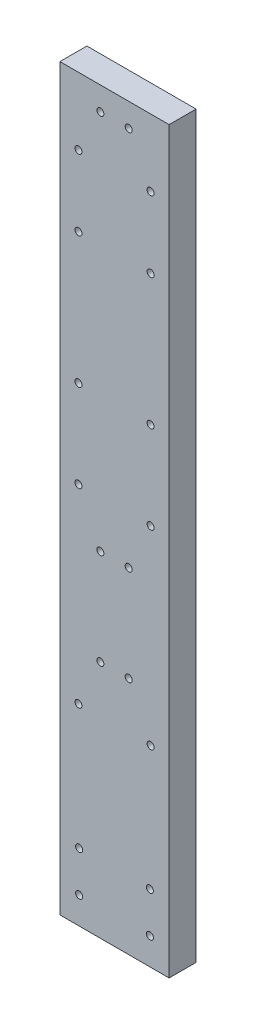
ISO-10303-21;
HEADER;
FILE_DESCRIPTION(('STEP AP214'),'2;1');
FILE_NAME('part.step','',(''),(''),'','','');
FILE_SCHEMA(('AUTOMOTIVE_DESIGN { 1 0 10303 214 1 1 1 1 }'));
ENDSEC;
DATA;
#1=APPLICATION_CONTEXT('core data for automotive mechanical design processes');
#2=APPLICATION_PROTOCOL_DEFINITION('international standard','automotive_design',2000,#1);
#3=PRODUCT_CONTEXT('',#1,'mechanical');
#4=PRODUCT('Part','Part','',(#3));
#5=PRODUCT_RELATED_PRODUCT_CATEGORY('part','',(#4));
#6=PRODUCT_DEFINITION_FORMATION('','',#4);
#7=PRODUCT_DEFINITION_CONTEXT('part definition',#1,'design');
#8=PRODUCT_DEFINITION('design','',#6,#7);
#9=PRODUCT_DEFINITION_SHAPE('','',#8);
#10=(LENGTH_UNIT() NAMED_UNIT(*) SI_UNIT(.MILLI.,.METRE.));
#11=(NAMED_UNIT(*) PLANE_ANGLE_UNIT() SI_UNIT($,.RADIAN.));
#12=(NAMED_UNIT(*) SI_UNIT($,.STERADIAN.) SOLID_ANGLE_UNIT());
#13=UNCERTAINTY_MEASURE_WITH_UNIT(LENGTH_MEASURE(1.E-05),#10,'distance_accuracy_value','');
#14=(GEOMETRIC_REPRESENTATION_CONTEXT(3) GLOBAL_UNCERTAINTY_ASSIGNED_CONTEXT((#13)) GLOBAL_UNIT_ASSIGNED_CONTEXT((#10,
#11,#12)) REPRESENTATION_CONTEXT('',''));
#15=CARTESIAN_POINT('',(0.,0.,0.));
#16=DIRECTION('',(0.,0.,1.));
#17=DIRECTION('',(1.,0.,0.));
#18=AXIS2_PLACEMENT_3D('',#15,#16,#17);
#19=CARTESIAN_POINT('',(0.,0.,4.));
#20=DIRECTION('',(0.,0.,1.));
#21=DIRECTION('',(1.,0.,0.));
#22=AXIS2_PLACEMENT_3D('',#19,#20,#21);
#23=PLANE('',#22);
#24=CARTESIAN_POINT('',(13.35,10.,4.));
#25=DIRECTION('',(0.,0.,1.));
#26=DIRECTION('',(-1.,0.,0.));
#27=AXIS2_PLACEMENT_3D('',#24,#25,#26);
#28=CIRCLE('',#27,0.519960121099866);
#29=CARTESIAN_POINT('',(12.8300398789001,10.,4.));
#30=VERTEX_POINT('',#29);
#31=EDGE_CURVE('E217',#30,#30,#28,.T.);
#32=ORIENTED_EDGE('',*,*,#31,.F.);
#33=EDGE_LOOP('',(#32));
#34=FACE_BOUND('',#33,.T.);
#35=CARTESIAN_POINT('',(2.85,10.,4.));
#36=DIRECTION('',(0.,0.,1.));
#37=DIRECTION('',(1.,0.,0.));
#38=AXIS2_PLACEMENT_3D('',#35,#36,#37);
#39=CIRCLE('',#38,0.519960121099865);
#40=CARTESIAN_POINT('',(3.36996012109986,10.,4.));
#41=VERTEX_POINT('',#40);
#42=EDGE_CURVE('E205',#41,#41,#39,.T.);
#43=ORIENTED_EDGE('',*,*,#42,.F.);
#44=EDGE_LOOP('',(#43));
#45=FACE_BOUND('',#44,.T.);
#46=CARTESIAN_POINT('',(2.74999999999998,69.71,4.));
#47=DIRECTION('',(0.,0.,1.));
#48=DIRECTION('',(1.,0.,0.));
#49=AXIS2_PLACEMENT_3D('',#46,#47,#48);
#50=CIRCLE('',#49,0.519960121099858);
#51=CARTESIAN_POINT('',(3.26996012109984,69.71,4.));
#52=VERTEX_POINT('',#51);
#53=EDGE_CURVE('E193',#52,#52,#50,.T.);
#54=ORIENTED_EDGE('',*,*,#53,.F.);
#55=EDGE_LOOP('',(#54));
#56=FACE_BOUND('',#55,.T.);
#57=CARTESIAN_POINT('',(2.74999999999999,56.71,4.));
#58=DIRECTION('',(0.,0.,1.));
#59=DIRECTION('',(1.,0.,0.));
#60=AXIS2_PLACEMENT_3D('',#57,#58,#59);
#61=CIRCLE('',#60,0.519960121099858);
#62=CARTESIAN_POINT('',(3.26996012109985,56.71,4.));
#63=VERTEX_POINT('',#62);
#64=EDGE_CURVE('E181',#63,#63,#61,.T.);
#65=ORIENTED_EDGE('',*,*,#64,.F.);
#66=EDGE_LOOP('',(#65));
#67=FACE_BOUND('',#66,.T.);
#68=CARTESIAN_POINT('',(10.2,106.16,4.));
#69=DIRECTION('',(0.,0.,1.));
#70=DIRECTION('',(-1.,0.,0.));
#71=AXIS2_PLACEMENT_3D('',#68,#69,#70);
#72=CIRCLE('',#71,0.519960121099869);
#73=CARTESIAN_POINT('',(9.68003987890012,106.16,4.));
#74=VERTEX_POINT('',#73);
#75=EDGE_CURVE('E169',#74,#74,#72,.T.);
#76=ORIENTED_EDGE('',*,*,#75,.F.);
#77=EDGE_LOOP('',(#76));
#78=FACE_BOUND('',#77,.T.);
#79=CARTESIAN_POINT('',(2.74999999999998,89.16,4.));
#80=DIRECTION('',(0.,0.,1.));
#81=DIRECTION('',(-1.,0.,0.));
#82=AXIS2_PLACEMENT_3D('',#79,#80,#81);
#83=CIRCLE('',#82,0.519960121099858);
#84=CARTESIAN_POINT('',(2.23003987890013,89.16,4.));
#85=VERTEX_POINT('',#84);
#86=EDGE_CURVE('E157',#85,#85,#83,.T.);
#87=ORIENTED_EDGE('',*,*,#86,.F.);
#88=EDGE_LOOP('',(#87));
#89=FACE_BOUND('',#88,.T.);
#90=CARTESIAN_POINT('',(2.75,28.5,4.));
#91=DIRECTION('',(0.,0.,1.));
#92=DIRECTION('',(1.,0.,0.));
#93=AXIS2_PLACEMENT_3D('',#90,#91,#92);
#94=CIRCLE('',#93,0.519960121099867);
#95=CARTESIAN_POINT('',(3.26996012109986,28.5,4.));
#96=VERTEX_POINT('',#95);
#97=EDGE_CURVE('E145',#96,#96,#94,.T.);
#98=ORIENTED_EDGE('',*,*,#97,.F.);
#99=EDGE_LOOP('',(#98));
#100=FACE_BOUND('',#99,.T.);
#101=CARTESIAN_POINT('',(6.,35.5,4.));
#102=DIRECTION('',(0.,0.,1.));
#103=DIRECTION('',(1.,0.,0.));
#104=AXIS2_PLACEMENT_3D('',#101,#102,#103);
#105=CIRCLE('',#104,0.51996012109988);
#106=CARTESIAN_POINT('',(6.51996012109988,35.5,4.));
#107=VERTEX_POINT('',#106);
#108=EDGE_CURVE('E133',#107,#107,#105,.T.);
#109=ORIENTED_EDGE('',*,*,#108,.F.);
#110=EDGE_LOOP('',(#109));
#111=FACE_BOUND('',#110,.T.);
#112=CARTESIAN_POINT('',(5.99999999999999,49.71,4.));
#113=DIRECTION('',(0.,0.,1.));
#114=DIRECTION('',(1.,0.,0.));
#115=AXIS2_PLACEMENT_3D('',#112,#113,#114);
#116=CIRCLE('',#115,0.519960121099861);
#117=CARTESIAN_POINT('',(6.51996012109985,49.71,4.));
#118=VERTEX_POINT('',#117);
#119=EDGE_CURVE('E121',#118,#118,#116,.T.);
#120=ORIENTED_EDGE('',*,*,#119,.F.);
#121=EDGE_LOOP('',(#120));
#122=FACE_BOUND('',#121,.T.);
#123=CARTESIAN_POINT('',(5.99999999999999,106.16,4.));
#124=DIRECTION('',(0.,0.,1.));
#125=DIRECTION('',(1.,0.,0.));
#126=AXIS2_PLACEMENT_3D('',#123,#124,#125);
#127=CIRCLE('',#126,0.519960121099861);
#128=CARTESIAN_POINT('',(6.51996012109985,106.16,4.));
#129=VERTEX_POINT('',#128);
#130=EDGE_CURVE('E100',#129,#129,#127,.T.);
#131=ORIENTED_EDGE('',*,*,#130,.F.);
#132=EDGE_LOOP('',(#131));
#133=FACE_BOUND('',#132,.T.);
#134=DIRECTION('',(0.,-1.,0.));
#135=VECTOR('',#134,1.);
#136=CARTESIAN_POINT('',(0.,109.64,4.));
#137=LINE('',#136,#135);
#138=CARTESIAN_POINT('',(0.,109.64,4.));
#139=VERTEX_POINT('',#138);
#140=CARTESIAN_POINT('',(0.,0.,4.));
#141=VERTEX_POINT('',#140);
#142=EDGE_CURVE('E85',#139,#141,#137,.T.);
#143=ORIENTED_EDGE('',*,*,#142,.T.);
#144=DIRECTION('',(1.,0.,0.));
#145=VECTOR('',#144,1.);
#146=CARTESIAN_POINT('',(0.,0.,4.));
#147=LINE('',#146,#145);
#148=CARTESIAN_POINT('',(16.2,0.,4.));
#149=VERTEX_POINT('',#148);
#150=EDGE_CURVE('E80',#141,#149,#147,.T.);
#151=ORIENTED_EDGE('',*,*,#150,.T.);
#152=DIRECTION('',(0.,1.,0.));
#153=VECTOR('',#152,1.);
#154=CARTESIAN_POINT('',(16.2,0.,4.));
#155=LINE('',#154,#153);
#156=CARTESIAN_POINT('',(16.2,109.64,4.));
#157=VERTEX_POINT('',#156);
#158=EDGE_CURVE('E83',#149,#157,#155,.T.);
#159=ORIENTED_EDGE('',*,*,#158,.T.);
#160=DIRECTION('',(-1.,0.,0.));
#161=VECTOR('',#160,1.);
#162=CARTESIAN_POINT('',(16.2,109.64,4.));
#163=LINE('',#162,#161);
#164=EDGE_CURVE('E50',#157,#139,#163,.T.);
#165=ORIENTED_EDGE('',*,*,#164,.T.);
#166=EDGE_LOOP('',(#143,#151,#159,#165));
#167=FACE_BOUND('',#166,.T.);
#168=CARTESIAN_POINT('',(10.2,49.71,4.));
#169=DIRECTION('',(0.,0.,1.));
#170=DIRECTION('',(1.,0.,0.));
#171=AXIS2_PLACEMENT_3D('',#168,#169,#170);
#172=CIRCLE('',#171,0.519960121099864);
#173=CARTESIAN_POINT('',(10.7199601210999,49.71,4.));
#174=VERTEX_POINT('',#173);
#175=EDGE_CURVE('E115',#174,#174,#172,.T.);
#176=ORIENTED_EDGE('',*,*,#175,.F.);
#177=EDGE_LOOP('',(#176));
#178=FACE_BOUND('',#177,.T.);
#179=CARTESIAN_POINT('',(10.2,35.5,4.));
#180=DIRECTION('',(0.,0.,1.));
#181=DIRECTION('',(1.,0.,0.));
#182=AXIS2_PLACEMENT_3D('',#179,#180,#181);
#183=CIRCLE('',#182,0.519960121099865);
#184=CARTESIAN_POINT('',(10.7199601210999,35.5,4.));
#185=VERTEX_POINT('',#184);
#186=EDGE_CURVE('E127',#185,#185,#183,.T.);
#187=ORIENTED_EDGE('',*,*,#186,.F.);
#188=EDGE_LOOP('',(#187));
#189=FACE_BOUND('',#188,.T.);
#190=CARTESIAN_POINT('',(13.45,28.5,4.));
#191=DIRECTION('',(0.,0.,1.));
#192=DIRECTION('',(1.,0.,0.));
#193=AXIS2_PLACEMENT_3D('',#190,#191,#192);
#194=CIRCLE('',#193,0.519960121099865);
#195=CARTESIAN_POINT('',(13.9699601210999,28.5,4.));
#196=VERTEX_POINT('',#195);
#197=EDGE_CURVE('E139',#196,#196,#194,.T.);
#198=ORIENTED_EDGE('',*,*,#197,.F.);
#199=EDGE_LOOP('',(#198));
#200=FACE_BOUND('',#199,.T.);
#201=CARTESIAN_POINT('',(13.45,56.71,4.));
#202=DIRECTION('',(0.,0.,1.));
#203=DIRECTION('',(1.,0.,0.));
#204=AXIS2_PLACEMENT_3D('',#201,#202,#203);
#205=CIRCLE('',#204,0.519960121099861);
#206=CARTESIAN_POINT('',(13.9699601210999,56.71,4.));
#207=VERTEX_POINT('',#206);
#208=EDGE_CURVE('E151',#207,#207,#205,.T.);
#209=ORIENTED_EDGE('',*,*,#208,.F.);
#210=EDGE_LOOP('',(#209));
#211=FACE_BOUND('',#210,.T.);
#212=CARTESIAN_POINT('',(13.45,89.16,4.));
#213=DIRECTION('',(0.,0.,1.));
#214=DIRECTION('',(-1.,0.,0.));
#215=AXIS2_PLACEMENT_3D('',#212,#213,#214);
#216=CIRCLE('',#215,0.519960121099861);
#217=CARTESIAN_POINT('',(12.9300398789001,89.16,4.));
#218=VERTEX_POINT('',#217);
#219=EDGE_CURVE('E163',#218,#218,#216,.T.);
#220=ORIENTED_EDGE('',*,*,#219,.F.);
#221=EDGE_LOOP('',(#220));
#222=FACE_BOUND('',#221,.T.);
#223=CARTESIAN_POINT('',(13.45,99.66,4.));
#224=DIRECTION('',(0.,0.,1.));
#225=DIRECTION('',(-1.,0.,0.));
#226=AXIS2_PLACEMENT_3D('',#223,#224,#225);
#227=CIRCLE('',#226,0.519960121099862);
#228=CARTESIAN_POINT('',(12.9300398789001,99.66,4.));
#229=VERTEX_POINT('',#228);
#230=EDGE_CURVE('E175',#229,#229,#227,.T.);
#231=ORIENTED_EDGE('',*,*,#230,.F.);
#232=EDGE_LOOP('',(#231));
#233=FACE_BOUND('',#232,.T.);
#234=CARTESIAN_POINT('',(13.45,69.71,4.));
#235=DIRECTION('',(0.,0.,1.));
#236=DIRECTION('',(1.,0.,0.));
#237=AXIS2_PLACEMENT_3D('',#234,#235,#236);
#238=CIRCLE('',#237,0.519960121099861);
#239=CARTESIAN_POINT('',(13.9699601210999,69.71,4.));
#240=VERTEX_POINT('',#239);
#241=EDGE_CURVE('E187',#240,#240,#238,.T.);
#242=ORIENTED_EDGE('',*,*,#241,.F.);
#243=EDGE_LOOP('',(#242));
#244=FACE_BOUND('',#243,.T.);
#245=CARTESIAN_POINT('',(2.74999999999999,99.66,4.));
#246=DIRECTION('',(0.,0.,1.));
#247=DIRECTION('',(1.,0.,0.));
#248=AXIS2_PLACEMENT_3D('',#245,#246,#247);
#249=CIRCLE('',#248,0.519960121099858);
#250=CARTESIAN_POINT('',(3.26996012109985,99.66,4.));
#251=VERTEX_POINT('',#250);
#252=EDGE_CURVE('E199',#251,#251,#249,.T.);
#253=ORIENTED_EDGE('',*,*,#252,.F.);
#254=EDGE_LOOP('',(#253));
#255=FACE_BOUND('',#254,.T.);
#256=CARTESIAN_POINT('',(2.85,4.,4.));
#257=DIRECTION('',(0.,0.,1.));
#258=DIRECTION('',(1.,0.,0.));
#259=AXIS2_PLACEMENT_3D('',#256,#257,#258);
#260=CIRCLE('',#259,0.519960121099865);
#261=CARTESIAN_POINT('',(3.36996012109986,4.,4.));
#262=VERTEX_POINT('',#261);
#263=EDGE_CURVE('E211',#262,#262,#260,.T.);
#264=ORIENTED_EDGE('',*,*,#263,.F.);
#265=EDGE_LOOP('',(#264));
#266=FACE_BOUND('',#265,.T.);
#267=CARTESIAN_POINT('',(13.35,4.,4.));
#268=DIRECTION('',(0.,0.,1.));
#269=DIRECTION('',(-1.,0.,0.));
#270=AXIS2_PLACEMENT_3D('',#267,#268,#269);
#271=CIRCLE('',#270,0.519960121099866);
#272=CARTESIAN_POINT('',(12.8300398789001,4.,4.));
#273=VERTEX_POINT('',#272);
#274=EDGE_CURVE('E223',#273,#273,#271,.T.);
#275=ORIENTED_EDGE('',*,*,#274,.F.);
#276=EDGE_LOOP('',(#275));
#277=FACE_BOUND('',#276,.T.);
#278=ADVANCED_FACE('F33',(#34,#45,#56,#67,#78,#89,#100,#111,#122,#133,#167,#178,#189,#200,#211,
#222,#233,#244,#255,#266,#277),#23,.T.);
#279=CARTESIAN_POINT('',(0.,0.,0.));
#280=DIRECTION('',(0.,0.,1.));
#281=DIRECTION('',(1.,0.,0.));
#282=AXIS2_PLACEMENT_3D('',#279,#280,#281);
#283=PLANE('',#282);
#284=CARTESIAN_POINT('',(13.35,10.,0.));
#285=DIRECTION('',(0.,0.,1.));
#286=DIRECTION('',(-1.,0.,0.));
#287=AXIS2_PLACEMENT_3D('',#284,#285,#286);
#288=CIRCLE('',#287,0.519960121099866);
#289=CARTESIAN_POINT('',(12.8300398789001,10.,0.));
#290=VERTEX_POINT('',#289);
#291=EDGE_CURVE('E220',#290,#290,#288,.T.);
#292=ORIENTED_EDGE('',*,*,#291,.T.);
#293=EDGE_LOOP('',(#292));
#294=FACE_BOUND('',#293,.T.);
#295=CARTESIAN_POINT('',(2.85,10.,0.));
#296=DIRECTION('',(0.,0.,1.));
#297=DIRECTION('',(1.,0.,0.));
#298=AXIS2_PLACEMENT_3D('',#295,#296,#297);
#299=CIRCLE('',#298,0.519960121099865);
#300=CARTESIAN_POINT('',(3.36996012109986,10.,0.));
#301=VERTEX_POINT('',#300);
#302=EDGE_CURVE('E208',#301,#301,#299,.T.);
#303=ORIENTED_EDGE('',*,*,#302,.T.);
#304=EDGE_LOOP('',(#303));
#305=FACE_BOUND('',#304,.T.);
#306=CARTESIAN_POINT('',(2.74999999999998,69.71,0.));
#307=DIRECTION('',(0.,0.,1.));
#308=DIRECTION('',(1.,0.,0.));
#309=AXIS2_PLACEMENT_3D('',#306,#307,#308);
#310=CIRCLE('',#309,0.519960121099858);
#311=CARTESIAN_POINT('',(3.26996012109984,69.71,0.));
#312=VERTEX_POINT('',#311);
#313=EDGE_CURVE('E196',#312,#312,#310,.T.);
#314=ORIENTED_EDGE('',*,*,#313,.T.);
#315=EDGE_LOOP('',(#314));
#316=FACE_BOUND('',#315,.T.);
#317=CARTESIAN_POINT('',(2.74999999999999,56.71,0.));
#318=DIRECTION('',(0.,0.,1.));
#319=DIRECTION('',(1.,0.,0.));
#320=AXIS2_PLACEMENT_3D('',#317,#318,#319);
#321=CIRCLE('',#320,0.519960121099858);
#322=CARTESIAN_POINT('',(3.26996012109985,56.71,0.));
#323=VERTEX_POINT('',#322);
#324=EDGE_CURVE('E184',#323,#323,#321,.T.);
#325=ORIENTED_EDGE('',*,*,#324,.T.);
#326=EDGE_LOOP('',(#325));
#327=FACE_BOUND('',#326,.T.);
#328=CARTESIAN_POINT('',(10.2,106.16,0.));
#329=DIRECTION('',(0.,0.,1.));
#330=DIRECTION('',(-1.,0.,0.));
#331=AXIS2_PLACEMENT_3D('',#328,#329,#330);
#332=CIRCLE('',#331,0.519960121099869);
#333=CARTESIAN_POINT('',(9.68003987890012,106.16,0.));
#334=VERTEX_POINT('',#333);
#335=EDGE_CURVE('E172',#334,#334,#332,.T.);
#336=ORIENTED_EDGE('',*,*,#335,.T.);
#337=EDGE_LOOP('',(#336));
#338=FACE_BOUND('',#337,.T.);
#339=CARTESIAN_POINT('',(2.74999999999998,89.16,0.));
#340=DIRECTION('',(0.,0.,1.));
#341=DIRECTION('',(-1.,0.,0.));
#342=AXIS2_PLACEMENT_3D('',#339,#340,#341);
#343=CIRCLE('',#342,0.519960121099858);
#344=CARTESIAN_POINT('',(2.23003987890013,89.16,0.));
#345=VERTEX_POINT('',#344);
#346=EDGE_CURVE('E160',#345,#345,#343,.T.);
#347=ORIENTED_EDGE('',*,*,#346,.T.);
#348=EDGE_LOOP('',(#347));
#349=FACE_BOUND('',#348,.T.);
#350=CARTESIAN_POINT('',(2.75,28.5,0.));
#351=DIRECTION('',(0.,0.,1.));
#352=DIRECTION('',(1.,0.,0.));
#353=AXIS2_PLACEMENT_3D('',#350,#351,#352);
#354=CIRCLE('',#353,0.519960121099867);
#355=CARTESIAN_POINT('',(3.26996012109986,28.5,0.));
#356=VERTEX_POINT('',#355);
#357=EDGE_CURVE('E148',#356,#356,#354,.T.);
#358=ORIENTED_EDGE('',*,*,#357,.T.);
#359=EDGE_LOOP('',(#358));
#360=FACE_BOUND('',#359,.T.);
#361=CARTESIAN_POINT('',(6.,35.5,0.));
#362=DIRECTION('',(0.,0.,1.));
#363=DIRECTION('',(1.,0.,0.));
#364=AXIS2_PLACEMENT_3D('',#361,#362,#363);
#365=CIRCLE('',#364,0.51996012109988);
#366=CARTESIAN_POINT('',(6.51996012109988,35.5,0.));
#367=VERTEX_POINT('',#366);
#368=EDGE_CURVE('E136',#367,#367,#365,.T.);
#369=ORIENTED_EDGE('',*,*,#368,.T.);
#370=EDGE_LOOP('',(#369));
#371=FACE_BOUND('',#370,.T.);
#372=CARTESIAN_POINT('',(5.99999999999999,49.71,0.));
#373=DIRECTION('',(0.,0.,1.));
#374=DIRECTION('',(1.,0.,0.));
#375=AXIS2_PLACEMENT_3D('',#372,#373,#374);
#376=CIRCLE('',#375,0.519960121099861);
#377=CARTESIAN_POINT('',(6.51996012109985,49.71,0.));
#378=VERTEX_POINT('',#377);
#379=EDGE_CURVE('E124',#378,#378,#376,.T.);
#380=ORIENTED_EDGE('',*,*,#379,.T.);
#381=EDGE_LOOP('',(#380));
#382=FACE_BOUND('',#381,.T.);
#383=CARTESIAN_POINT('',(5.99999999999999,106.16,0.));
#384=DIRECTION('',(0.,0.,1.));
#385=DIRECTION('',(1.,0.,0.));
#386=AXIS2_PLACEMENT_3D('',#383,#384,#385);
#387=CIRCLE('',#386,0.519960121099861);
#388=CARTESIAN_POINT('',(6.51996012109985,106.16,0.));
#389=VERTEX_POINT('',#388);
#390=EDGE_CURVE('E112',#389,#389,#387,.T.);
#391=ORIENTED_EDGE('',*,*,#390,.T.);
#392=EDGE_LOOP('',(#391));
#393=FACE_BOUND('',#392,.T.);
#394=DIRECTION('',(0.,-1.,0.));
#395=VECTOR('',#394,1.);
#396=CARTESIAN_POINT('',(0.,109.64,0.));
#397=LINE('',#396,#395);
#398=CARTESIAN_POINT('',(0.,109.64,0.));
#399=VERTEX_POINT('',#398);
#400=CARTESIAN_POINT('',(0.,0.,0.));
#401=VERTEX_POINT('',#400);
#402=EDGE_CURVE('E97',#399,#401,#397,.T.);
#403=ORIENTED_EDGE('',*,*,#402,.F.);
#404=DIRECTION('',(-1.,0.,0.));
#405=VECTOR('',#404,1.);
#406=CARTESIAN_POINT('',(16.2,109.64,0.));
#407=LINE('',#406,#405);
#408=CARTESIAN_POINT('',(16.2,109.64,0.));
#409=VERTEX_POINT('',#408);
#410=EDGE_CURVE('E73',#409,#399,#407,.T.);
#411=ORIENTED_EDGE('',*,*,#410,.F.);
#412=DIRECTION('',(0.,1.,0.));
#413=VECTOR('',#412,1.);
#414=CARTESIAN_POINT('',(16.2,0.,0.));
#415=LINE('',#414,#413);
#416=CARTESIAN_POINT('',(16.2,0.,0.));
#417=VERTEX_POINT('',#416);
#418=EDGE_CURVE('E67',#417,#409,#415,.T.);
#419=ORIENTED_EDGE('',*,*,#418,.F.);
#420=DIRECTION('',(1.,0.,0.));
#421=VECTOR('',#420,1.);
#422=CARTESIAN_POINT('',(0.,0.,0.));
#423=LINE('',#422,#421);
#424=EDGE_CURVE('E89',#401,#417,#423,.T.);
#425=ORIENTED_EDGE('',*,*,#424,.F.);
#426=EDGE_LOOP('',(#403,#411,#419,#425));
#427=FACE_BOUND('',#426,.T.);
#428=CARTESIAN_POINT('',(10.2,49.71,0.));
#429=DIRECTION('',(0.,0.,1.));
#430=DIRECTION('',(1.,0.,0.));
#431=AXIS2_PLACEMENT_3D('',#428,#429,#430);
#432=CIRCLE('',#431,0.519960121099864);
#433=CARTESIAN_POINT('',(10.7199601210999,49.71,0.));
#434=VERTEX_POINT('',#433);
#435=EDGE_CURVE('E118',#434,#434,#432,.T.);
#436=ORIENTED_EDGE('',*,*,#435,.T.);
#437=EDGE_LOOP('',(#436));
#438=FACE_BOUND('',#437,.T.);
#439=CARTESIAN_POINT('',(10.2,35.5,0.));
#440=DIRECTION('',(0.,0.,1.));
#441=DIRECTION('',(1.,0.,0.));
#442=AXIS2_PLACEMENT_3D('',#439,#440,#441);
#443=CIRCLE('',#442,0.519960121099865);
#444=CARTESIAN_POINT('',(10.7199601210999,35.5,0.));
#445=VERTEX_POINT('',#444);
#446=EDGE_CURVE('E130',#445,#445,#443,.T.);
#447=ORIENTED_EDGE('',*,*,#446,.T.);
#448=EDGE_LOOP('',(#447));
#449=FACE_BOUND('',#448,.T.);
#450=CARTESIAN_POINT('',(13.45,28.5,0.));
#451=DIRECTION('',(0.,0.,1.));
#452=DIRECTION('',(1.,0.,0.));
#453=AXIS2_PLACEMENT_3D('',#450,#451,#452);
#454=CIRCLE('',#453,0.519960121099865);
#455=CARTESIAN_POINT('',(13.9699601210999,28.5,0.));
#456=VERTEX_POINT('',#455);
#457=EDGE_CURVE('E142',#456,#456,#454,.T.);
#458=ORIENTED_EDGE('',*,*,#457,.T.);
#459=EDGE_LOOP('',(#458));
#460=FACE_BOUND('',#459,.T.);
#461=CARTESIAN_POINT('',(13.45,56.71,0.));
#462=DIRECTION('',(0.,0.,1.));
#463=DIRECTION('',(1.,0.,0.));
#464=AXIS2_PLACEMENT_3D('',#461,#462,#463);
#465=CIRCLE('',#464,0.519960121099861);
#466=CARTESIAN_POINT('',(13.9699601210999,56.71,0.));
#467=VERTEX_POINT('',#466);
#468=EDGE_CURVE('E154',#467,#467,#465,.T.);
#469=ORIENTED_EDGE('',*,*,#468,.T.);
#470=EDGE_LOOP('',(#469));
#471=FACE_BOUND('',#470,.T.);
#472=CARTESIAN_POINT('',(13.45,89.16,0.));
#473=DIRECTION('',(0.,0.,1.));
#474=DIRECTION('',(-1.,0.,0.));
#475=AXIS2_PLACEMENT_3D('',#472,#473,#474);
#476=CIRCLE('',#475,0.519960121099861);
#477=CARTESIAN_POINT('',(12.9300398789001,89.16,0.));
#478=VERTEX_POINT('',#477);
#479=EDGE_CURVE('E166',#478,#478,#476,.T.);
#480=ORIENTED_EDGE('',*,*,#479,.T.);
#481=EDGE_LOOP('',(#480));
#482=FACE_BOUND('',#481,.T.);
#483=CARTESIAN_POINT('',(13.45,99.66,0.));
#484=DIRECTION('',(0.,0.,1.));
#485=DIRECTION('',(-1.,0.,0.));
#486=AXIS2_PLACEMENT_3D('',#483,#484,#485);
#487=CIRCLE('',#486,0.519960121099862);
#488=CARTESIAN_POINT('',(12.9300398789001,99.66,0.));
#489=VERTEX_POINT('',#488);
#490=EDGE_CURVE('E178',#489,#489,#487,.T.);
#491=ORIENTED_EDGE('',*,*,#490,.T.);
#492=EDGE_LOOP('',(#491));
#493=FACE_BOUND('',#492,.T.);
#494=CARTESIAN_POINT('',(13.45,69.71,0.));
#495=DIRECTION('',(0.,0.,1.));
#496=DIRECTION('',(1.,0.,0.));
#497=AXIS2_PLACEMENT_3D('',#494,#495,#496);
#498=CIRCLE('',#497,0.519960121099861);
#499=CARTESIAN_POINT('',(13.9699601210999,69.71,0.));
#500=VERTEX_POINT('',#499);
#501=EDGE_CURVE('E190',#500,#500,#498,.T.);
#502=ORIENTED_EDGE('',*,*,#501,.T.);
#503=EDGE_LOOP('',(#502));
#504=FACE_BOUND('',#503,.T.);
#505=CARTESIAN_POINT('',(2.74999999999999,99.66,0.));
#506=DIRECTION('',(0.,0.,1.));
#507=DIRECTION('',(1.,0.,0.));
#508=AXIS2_PLACEMENT_3D('',#505,#506,#507);
#509=CIRCLE('',#508,0.519960121099858);
#510=CARTESIAN_POINT('',(3.26996012109985,99.66,0.));
#511=VERTEX_POINT('',#510);
#512=EDGE_CURVE('E202',#511,#511,#509,.T.);
#513=ORIENTED_EDGE('',*,*,#512,.T.);
#514=EDGE_LOOP('',(#513));
#515=FACE_BOUND('',#514,.T.);
#516=CARTESIAN_POINT('',(2.85,4.,0.));
#517=DIRECTION('',(0.,0.,1.));
#518=DIRECTION('',(1.,0.,0.));
#519=AXIS2_PLACEMENT_3D('',#516,#517,#518);
#520=CIRCLE('',#519,0.519960121099865);
#521=CARTESIAN_POINT('',(3.36996012109986,4.,0.));
#522=VERTEX_POINT('',#521);
#523=EDGE_CURVE('E214',#522,#522,#520,.T.);
#524=ORIENTED_EDGE('',*,*,#523,.T.);
#525=EDGE_LOOP('',(#524));
#526=FACE_BOUND('',#525,.T.);
#527=CARTESIAN_POINT('',(13.35,4.,0.));
#528=DIRECTION('',(0.,0.,1.));
#529=DIRECTION('',(-1.,0.,0.));
#530=AXIS2_PLACEMENT_3D('',#527,#528,#529);
#531=CIRCLE('',#530,0.519960121099866);
#532=CARTESIAN_POINT('',(12.8300398789001,4.,0.));
#533=VERTEX_POINT('',#532);
#534=EDGE_CURVE('E226',#533,#533,#531,.T.);
#535=ORIENTED_EDGE('',*,*,#534,.T.);
#536=EDGE_LOOP('',(#535));
#537=FACE_BOUND('',#536,.T.);
#538=ADVANCED_FACE('F108',(#294,#305,#316,#327,#338,#349,#360,#371,#382,#393,#427,#438,#449,
#460,#471,#482,#493,#504,#515,#526,#537),#283,.F.);
#539=CARTESIAN_POINT('',(0.,109.64,4.));
#540=DIRECTION('',(1.,0.,0.));
#541=DIRECTION('',(0.,1.,0.));
#542=AXIS2_PLACEMENT_3D('',#539,#540,#541);
#543=PLANE('',#542);
#544=ORIENTED_EDGE('',*,*,#402,.T.);
#545=DIRECTION('',(0.,0.,-1.));
#546=VECTOR('',#545,1.);
#547=CARTESIAN_POINT('',(0.,0.,4.));
#548=LINE('',#547,#546);
#549=EDGE_CURVE('E11',#141,#401,#548,.T.);
#550=ORIENTED_EDGE('',*,*,#549,.F.);
#551=ORIENTED_EDGE('',*,*,#142,.F.);
#552=DIRECTION('',(0.,0.,-1.));
#553=VECTOR('',#552,1.);
#554=CARTESIAN_POINT('',(0.,109.64,4.));
#555=LINE('',#554,#553);
#556=EDGE_CURVE('E93',#139,#399,#555,.T.);
#557=ORIENTED_EDGE('',*,*,#556,.T.);
#558=EDGE_LOOP('',(#544,#550,#551,#557));
#559=FACE_BOUND('',#558,.T.);
#560=ADVANCED_FACE('F35',(#559),#543,.F.);
#561=CARTESIAN_POINT('',(0.,0.,4.));
#562=DIRECTION('',(0.,1.,0.));
#563=DIRECTION('',(-1.,0.,0.));
#564=AXIS2_PLACEMENT_3D('',#561,#562,#563);
#565=PLANE('',#564);
#566=ORIENTED_EDGE('',*,*,#424,.T.);
#567=DIRECTION('',(0.,0.,-1.));
#568=VECTOR('',#567,1.);
#569=CARTESIAN_POINT('',(16.2,0.,4.));
#570=LINE('',#569,#568);
#571=EDGE_CURVE('E42',#149,#417,#570,.T.);
#572=ORIENTED_EDGE('',*,*,#571,.F.);
#573=ORIENTED_EDGE('',*,*,#150,.F.);
#574=ORIENTED_EDGE('',*,*,#549,.T.);
#575=EDGE_LOOP('',(#566,#572,#573,#574));
#576=FACE_BOUND('',#575,.T.);
#577=ADVANCED_FACE('F88',(#576),#565,.F.);
#578=CARTESIAN_POINT('',(16.2,0.,4.));
#579=DIRECTION('',(-1.,0.,0.));
#580=DIRECTION('',(0.,-1.,0.));
#581=AXIS2_PLACEMENT_3D('',#578,#579,#580);
#582=PLANE('',#581);
#583=ORIENTED_EDGE('',*,*,#418,.T.);
#584=DIRECTION('',(0.,0.,-1.));
#585=VECTOR('',#584,1.);
#586=CARTESIAN_POINT('',(16.2,109.64,4.));
#587=LINE('',#586,#585);
#588=EDGE_CURVE('E90',#157,#409,#587,.T.);
#589=ORIENTED_EDGE('',*,*,#588,.F.);
#590=ORIENTED_EDGE('',*,*,#158,.F.);
#591=ORIENTED_EDGE('',*,*,#571,.T.);
#592=EDGE_LOOP('',(#583,#589,#590,#591));
#593=FACE_BOUND('',#592,.T.);
#594=ADVANCED_FACE('F91',(#593),#582,.F.);
#595=CARTESIAN_POINT('',(16.2,109.64,4.));
#596=DIRECTION('',(0.,-1.,0.));
#597=DIRECTION('',(0.,0.,-1.));
#598=AXIS2_PLACEMENT_3D('',#595,#596,#597);
#599=PLANE('',#598);
#600=ORIENTED_EDGE('',*,*,#410,.T.);
#601=ORIENTED_EDGE('',*,*,#556,.F.);
#602=ORIENTED_EDGE('',*,*,#164,.F.);
#603=ORIENTED_EDGE('',*,*,#588,.T.);
#604=EDGE_LOOP('',(#600,#601,#602,#603));
#605=FACE_BOUND('',#604,.T.);
#606=ADVANCED_FACE('F105',(#605),#599,.F.);
#607=CARTESIAN_POINT('',(5.99999999999999,106.16,4.));
#608=DIRECTION('',(0.,0.,-1.));
#609=DIRECTION('',(-1.,0.,0.));
#610=AXIS2_PLACEMENT_3D('',#607,#608,#609);
#611=CYLINDRICAL_SURFACE('',#610,0.519960121099861);
#612=ORIENTED_EDGE('',*,*,#130,.T.);
#613=EDGE_LOOP('',(#612));
#614=FACE_BOUND('',#613,.T.);
#615=ORIENTED_EDGE('',*,*,#390,.F.);
#616=EDGE_LOOP('',(#615));
#617=FACE_BOUND('',#616,.T.);
#618=ADVANCED_FACE('F246',(#614,#617),#611,.F.);
#619=CARTESIAN_POINT('',(10.2,49.71,4.));
#620=DIRECTION('',(0.,0.,-1.));
#621=DIRECTION('',(-1.,0.,0.));
#622=AXIS2_PLACEMENT_3D('',#619,#620,#621);
#623=CYLINDRICAL_SURFACE('',#622,0.519960121099864);
#624=ORIENTED_EDGE('',*,*,#175,.T.);
#625=EDGE_LOOP('',(#624));
#626=FACE_BOUND('',#625,.T.);
#627=ORIENTED_EDGE('',*,*,#435,.F.);
#628=EDGE_LOOP('',(#627));
#629=FACE_BOUND('',#628,.T.);
#630=ADVANCED_FACE('F292',(#626,#629),#623,.F.);
#631=CARTESIAN_POINT('',(5.99999999999999,49.71,4.));
#632=DIRECTION('',(0.,0.,-1.));
#633=DIRECTION('',(-1.,0.,0.));
#634=AXIS2_PLACEMENT_3D('',#631,#632,#633);
#635=CYLINDRICAL_SURFACE('',#634,0.519960121099861);
#636=ORIENTED_EDGE('',*,*,#119,.T.);
#637=EDGE_LOOP('',(#636));
#638=FACE_BOUND('',#637,.T.);
#639=ORIENTED_EDGE('',*,*,#379,.F.);
#640=EDGE_LOOP('',(#639));
#641=FACE_BOUND('',#640,.T.);
#642=ADVANCED_FACE('F300',(#638,#641),#635,.F.);
#643=CARTESIAN_POINT('',(10.2,35.5,4.));
#644=DIRECTION('',(0.,0.,-1.));
#645=DIRECTION('',(-1.,0.,0.));
#646=AXIS2_PLACEMENT_3D('',#643,#644,#645);
#647=CYLINDRICAL_SURFACE('',#646,0.519960121099865);
#648=ORIENTED_EDGE('',*,*,#186,.T.);
#649=EDGE_LOOP('',(#648));
#650=FACE_BOUND('',#649,.T.);
#651=ORIENTED_EDGE('',*,*,#446,.F.);
#652=EDGE_LOOP('',(#651));
#653=FACE_BOUND('',#652,.T.);
#654=ADVANCED_FACE('F308',(#650,#653),#647,.F.);
#655=CARTESIAN_POINT('',(6.,35.5,4.));
#656=DIRECTION('',(0.,0.,-1.));
#657=DIRECTION('',(-1.,0.,0.));
#658=AXIS2_PLACEMENT_3D('',#655,#656,#657);
#659=CYLINDRICAL_SURFACE('',#658,0.51996012109988);
#660=ORIENTED_EDGE('',*,*,#108,.T.);
#661=EDGE_LOOP('',(#660));
#662=FACE_BOUND('',#661,.T.);
#663=ORIENTED_EDGE('',*,*,#368,.F.);
#664=EDGE_LOOP('',(#663));
#665=FACE_BOUND('',#664,.T.);
#666=ADVANCED_FACE('F317',(#662,#665),#659,.F.);
#667=CARTESIAN_POINT('',(13.45,28.5,4.));
#668=DIRECTION('',(0.,0.,-1.));
#669=DIRECTION('',(-1.,0.,0.));
#670=AXIS2_PLACEMENT_3D('',#667,#668,#669);
#671=CYLINDRICAL_SURFACE('',#670,0.519960121099865);
#672=ORIENTED_EDGE('',*,*,#197,.T.);
#673=EDGE_LOOP('',(#672));
#674=FACE_BOUND('',#673,.T.);
#675=ORIENTED_EDGE('',*,*,#457,.F.);
#676=EDGE_LOOP('',(#675));
#677=FACE_BOUND('',#676,.T.);
#678=ADVANCED_FACE('F326',(#674,#677),#671,.F.);
#679=CARTESIAN_POINT('',(2.75,28.5,4.));
#680=DIRECTION('',(0.,0.,-1.));
#681=DIRECTION('',(-1.,0.,0.));
#682=AXIS2_PLACEMENT_3D('',#679,#680,#681);
#683=CYLINDRICAL_SURFACE('',#682,0.519960121099867);
#684=ORIENTED_EDGE('',*,*,#97,.T.);
#685=EDGE_LOOP('',(#684));
#686=FACE_BOUND('',#685,.T.);
#687=ORIENTED_EDGE('',*,*,#357,.F.);
#688=EDGE_LOOP('',(#687));
#689=FACE_BOUND('',#688,.T.);
#690=ADVANCED_FACE('F335',(#686,#689),#683,.F.);
#691=CARTESIAN_POINT('',(13.45,56.71,4.));
#692=DIRECTION('',(0.,0.,-1.));
#693=DIRECTION('',(-1.,0.,0.));
#694=AXIS2_PLACEMENT_3D('',#691,#692,#693);
#695=CYLINDRICAL_SURFACE('',#694,0.519960121099861);
#696=ORIENTED_EDGE('',*,*,#208,.T.);
#697=EDGE_LOOP('',(#696));
#698=FACE_BOUND('',#697,.T.);
#699=ORIENTED_EDGE('',*,*,#468,.F.);
#700=EDGE_LOOP('',(#699));
#701=FACE_BOUND('',#700,.T.);
#702=ADVANCED_FACE('F344',(#698,#701),#695,.F.);
#703=CARTESIAN_POINT('',(2.74999999999998,89.16,4.));
#704=DIRECTION('',(0.,0.,-1.));
#705=DIRECTION('',(-1.,0.,0.));
#706=AXIS2_PLACEMENT_3D('',#703,#704,#705);
#707=CYLINDRICAL_SURFACE('',#706,0.519960121099858);
#708=ORIENTED_EDGE('',*,*,#86,.T.);
#709=EDGE_LOOP('',(#708));
#710=FACE_BOUND('',#709,.T.);
#711=ORIENTED_EDGE('',*,*,#346,.F.);
#712=EDGE_LOOP('',(#711));
#713=FACE_BOUND('',#712,.T.);
#714=ADVANCED_FACE('F353',(#710,#713),#707,.F.);
#715=CARTESIAN_POINT('',(13.45,89.16,4.));
#716=DIRECTION('',(0.,0.,-1.));
#717=DIRECTION('',(-1.,0.,0.));
#718=AXIS2_PLACEMENT_3D('',#715,#716,#717);
#719=CYLINDRICAL_SURFACE('',#718,0.519960121099861);
#720=ORIENTED_EDGE('',*,*,#219,.T.);
#721=EDGE_LOOP('',(#720));
#722=FACE_BOUND('',#721,.T.);
#723=ORIENTED_EDGE('',*,*,#479,.F.);
#724=EDGE_LOOP('',(#723));
#725=FACE_BOUND('',#724,.T.);
#726=ADVANCED_FACE('F362',(#722,#725),#719,.F.);
#727=CARTESIAN_POINT('',(10.2,106.16,4.));
#728=DIRECTION('',(0.,0.,-1.));
#729=DIRECTION('',(-1.,0.,0.));
#730=AXIS2_PLACEMENT_3D('',#727,#728,#729);
#731=CYLINDRICAL_SURFACE('',#730,0.519960121099869);
#732=ORIENTED_EDGE('',*,*,#75,.T.);
#733=EDGE_LOOP('',(#732));
#734=FACE_BOUND('',#733,.T.);
#735=ORIENTED_EDGE('',*,*,#335,.F.);
#736=EDGE_LOOP('',(#735));
#737=FACE_BOUND('',#736,.T.);
#738=ADVANCED_FACE('F371',(#734,#737),#731,.F.);
#739=CARTESIAN_POINT('',(13.45,99.66,4.));
#740=DIRECTION('',(0.,0.,-1.));
#741=DIRECTION('',(-1.,0.,0.));
#742=AXIS2_PLACEMENT_3D('',#739,#740,#741);
#743=CYLINDRICAL_SURFACE('',#742,0.519960121099862);
#744=ORIENTED_EDGE('',*,*,#230,.T.);
#745=EDGE_LOOP('',(#744));
#746=FACE_BOUND('',#745,.T.);
#747=ORIENTED_EDGE('',*,*,#490,.F.);
#748=EDGE_LOOP('',(#747));
#749=FACE_BOUND('',#748,.T.);
#750=ADVANCED_FACE('F380',(#746,#749),#743,.F.);
#751=CARTESIAN_POINT('',(2.74999999999999,56.71,4.));
#752=DIRECTION('',(0.,0.,-1.));
#753=DIRECTION('',(-1.,0.,0.));
#754=AXIS2_PLACEMENT_3D('',#751,#752,#753);
#755=CYLINDRICAL_SURFACE('',#754,0.519960121099858);
#756=ORIENTED_EDGE('',*,*,#64,.T.);
#757=EDGE_LOOP('',(#756));
#758=FACE_BOUND('',#757,.T.);
#759=ORIENTED_EDGE('',*,*,#324,.F.);
#760=EDGE_LOOP('',(#759));
#761=FACE_BOUND('',#760,.T.);
#762=ADVANCED_FACE('F389',(#758,#761),#755,.F.);
#763=CARTESIAN_POINT('',(13.45,69.71,4.));
#764=DIRECTION('',(0.,0.,-1.));
#765=DIRECTION('',(-1.,0.,0.));
#766=AXIS2_PLACEMENT_3D('',#763,#764,#765);
#767=CYLINDRICAL_SURFACE('',#766,0.519960121099861);
#768=ORIENTED_EDGE('',*,*,#241,.T.);
#769=EDGE_LOOP('',(#768));
#770=FACE_BOUND('',#769,.T.);
#771=ORIENTED_EDGE('',*,*,#501,.F.);
#772=EDGE_LOOP('',(#771));
#773=FACE_BOUND('',#772,.T.);
#774=ADVANCED_FACE('F398',(#770,#773),#767,.F.);
#775=CARTESIAN_POINT('',(2.74999999999998,69.71,4.));
#776=DIRECTION('',(0.,0.,-1.));
#777=DIRECTION('',(-1.,0.,0.));
#778=AXIS2_PLACEMENT_3D('',#775,#776,#777);
#779=CYLINDRICAL_SURFACE('',#778,0.519960121099858);
#780=ORIENTED_EDGE('',*,*,#53,.T.);
#781=EDGE_LOOP('',(#780));
#782=FACE_BOUND('',#781,.T.);
#783=ORIENTED_EDGE('',*,*,#313,.F.);
#784=EDGE_LOOP('',(#783));
#785=FACE_BOUND('',#784,.T.);
#786=ADVANCED_FACE('F407',(#782,#785),#779,.F.);
#787=CARTESIAN_POINT('',(2.74999999999999,99.66,4.));
#788=DIRECTION('',(0.,0.,-1.));
#789=DIRECTION('',(-1.,0.,0.));
#790=AXIS2_PLACEMENT_3D('',#787,#788,#789);
#791=CYLINDRICAL_SURFACE('',#790,0.519960121099858);
#792=ORIENTED_EDGE('',*,*,#252,.T.);
#793=EDGE_LOOP('',(#792));
#794=FACE_BOUND('',#793,.T.);
#795=ORIENTED_EDGE('',*,*,#512,.F.);
#796=EDGE_LOOP('',(#795));
#797=FACE_BOUND('',#796,.T.);
#798=ADVANCED_FACE('F416',(#794,#797),#791,.F.);
#799=CARTESIAN_POINT('',(2.85,10.,4.));
#800=DIRECTION('',(0.,0.,-1.));
#801=DIRECTION('',(-1.,0.,0.));
#802=AXIS2_PLACEMENT_3D('',#799,#800,#801);
#803=CYLINDRICAL_SURFACE('',#802,0.519960121099865);
#804=ORIENTED_EDGE('',*,*,#42,.T.);
#805=EDGE_LOOP('',(#804));
#806=FACE_BOUND('',#805,.T.);
#807=ORIENTED_EDGE('',*,*,#302,.F.);
#808=EDGE_LOOP('',(#807));
#809=FACE_BOUND('',#808,.T.);
#810=ADVANCED_FACE('F425',(#806,#809),#803,.F.);
#811=CARTESIAN_POINT('',(2.85,4.,4.));
#812=DIRECTION('',(0.,0.,-1.));
#813=DIRECTION('',(-1.,0.,0.));
#814=AXIS2_PLACEMENT_3D('',#811,#812,#813);
#815=CYLINDRICAL_SURFACE('',#814,0.519960121099865);
#816=ORIENTED_EDGE('',*,*,#263,.T.);
#817=EDGE_LOOP('',(#816));
#818=FACE_BOUND('',#817,.T.);
#819=ORIENTED_EDGE('',*,*,#523,.F.);
#820=EDGE_LOOP('',(#819));
#821=FACE_BOUND('',#820,.T.);
#822=ADVANCED_FACE('F434',(#818,#821),#815,.F.);
#823=CARTESIAN_POINT('',(13.35,10.,4.));
#824=DIRECTION('',(0.,0.,-1.));
#825=DIRECTION('',(-1.,0.,0.));
#826=AXIS2_PLACEMENT_3D('',#823,#824,#825);
#827=CYLINDRICAL_SURFACE('',#826,0.519960121099866);
#828=ORIENTED_EDGE('',*,*,#31,.T.);
#829=EDGE_LOOP('',(#828));
#830=FACE_BOUND('',#829,.T.);
#831=ORIENTED_EDGE('',*,*,#291,.F.);
#832=EDGE_LOOP('',(#831));
#833=FACE_BOUND('',#832,.T.);
#834=ADVANCED_FACE('F443',(#830,#833),#827,.F.);
#835=CARTESIAN_POINT('',(13.35,4.,4.));
#836=DIRECTION('',(0.,0.,-1.));
#837=DIRECTION('',(-1.,0.,0.));
#838=AXIS2_PLACEMENT_3D('',#835,#836,#837);
#839=CYLINDRICAL_SURFACE('',#838,0.519960121099866);
#840=ORIENTED_EDGE('',*,*,#274,.T.);
#841=EDGE_LOOP('',(#840));
#842=FACE_BOUND('',#841,.T.);
#843=ORIENTED_EDGE('',*,*,#534,.F.);
#844=EDGE_LOOP('',(#843));
#845=FACE_BOUND('',#844,.T.);
#846=ADVANCED_FACE('F232',(#842,#845),#839,.F.);
#847=CLOSED_SHELL('',(#278,#538,#560,#577,#594,#606,#618,#630,#642,#654,#666,#678,#690,#702,
#714,#726,#738,#750,#762,#774,#786,#798,#810,#822,#834,#846));
#848=MANIFOLD_SOLID_BREP('B2',#847);
#849=ADVANCED_BREP_SHAPE_REPRESENTATION('',(#18,#848),#14);
#850=SHAPE_DEFINITION_REPRESENTATION(#9,#849);
ENDSEC;
END-ISO-10303-21;
